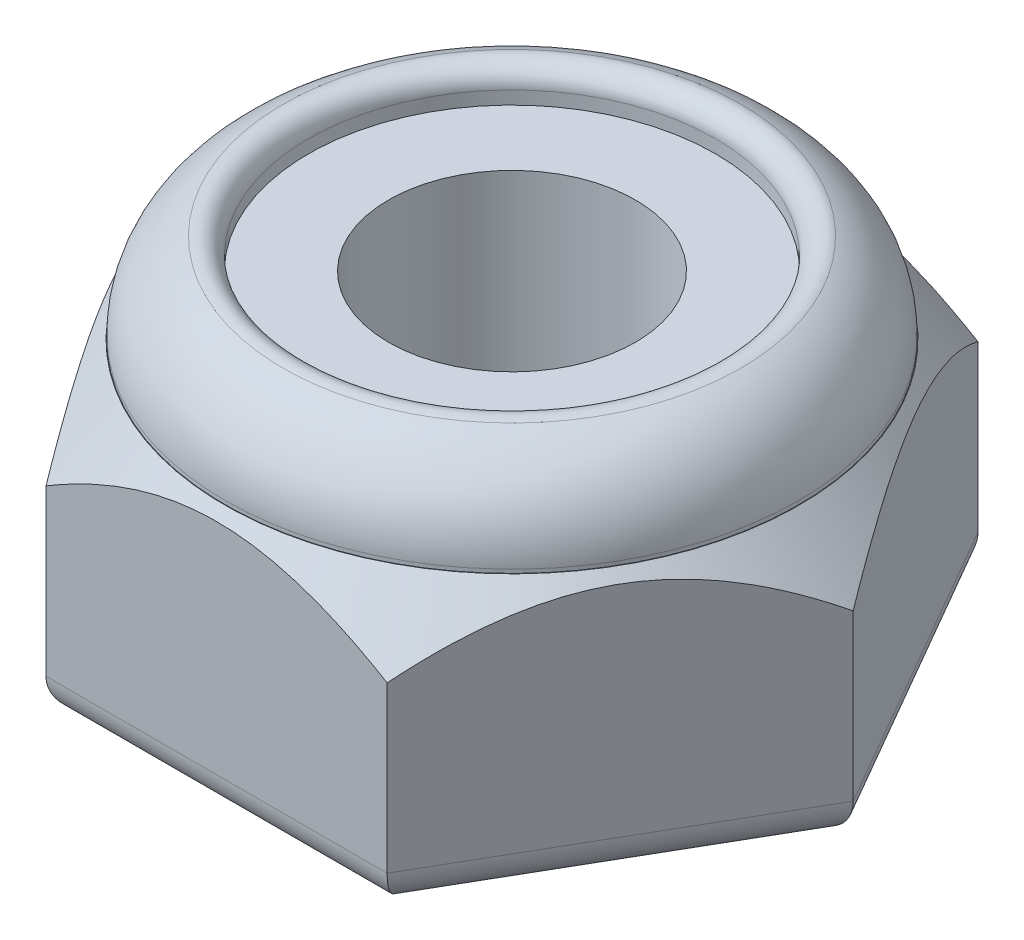
ISO-10303-21;
HEADER;
FILE_DESCRIPTION(('STEP AP214'),'2;1');
FILE_NAME('part.step','',(''),(''),'','','');
FILE_SCHEMA(('AUTOMOTIVE_DESIGN { 1 0 10303 214 1 1 1 1 }'));
ENDSEC;
DATA;
#1=APPLICATION_CONTEXT('core data for automotive mechanical design processes');
#2=APPLICATION_PROTOCOL_DEFINITION('international standard','automotive_design',2000,#1);
#3=PRODUCT_CONTEXT('',#1,'mechanical');
#4=PRODUCT('Part','Part','',(#3));
#5=PRODUCT_RELATED_PRODUCT_CATEGORY('part','',(#4));
#6=PRODUCT_DEFINITION_FORMATION('','',#4);
#7=PRODUCT_DEFINITION_CONTEXT('part definition',#1,'design');
#8=PRODUCT_DEFINITION('design','',#6,#7);
#9=PRODUCT_DEFINITION_SHAPE('','',#8);
#10=(LENGTH_UNIT() NAMED_UNIT(*) SI_UNIT(.MILLI.,.METRE.));
#11=(NAMED_UNIT(*) PLANE_ANGLE_UNIT() SI_UNIT($,.RADIAN.));
#12=(NAMED_UNIT(*) SI_UNIT($,.STERADIAN.) SOLID_ANGLE_UNIT());
#13=UNCERTAINTY_MEASURE_WITH_UNIT(LENGTH_MEASURE(1.E-05),#10,'distance_accuracy_value','');
#14=(GEOMETRIC_REPRESENTATION_CONTEXT(3) GLOBAL_UNCERTAINTY_ASSIGNED_CONTEXT((#13)) GLOBAL_UNIT_ASSIGNED_CONTEXT((#10,
#11,#12)) REPRESENTATION_CONTEXT('',''));
#15=CARTESIAN_POINT('',(0.,0.,0.));
#16=DIRECTION('',(0.,0.,1.));
#17=DIRECTION('',(1.,0.,0.));
#18=AXIS2_PLACEMENT_3D('',#15,#16,#17);
#19=CARTESIAN_POINT('',(0.,4.9784,0.));
#20=DIRECTION('',(0.,-1.,0.));
#21=DIRECTION('',(0.,0.,-1.));
#22=AXIS2_PLACEMENT_3D('',#19,#20,#21);
#23=CYLINDRICAL_SURFACE('',#22,3.937);
#24=CARTESIAN_POINT('',(0.,3.7084,0.));
#25=DIRECTION('',(0.,1.,0.));
#26=DIRECTION('',(0.,0.,1.));
#27=AXIS2_PLACEMENT_3D('',#24,#25,#26);
#28=CIRCLE('',#27,3.937);
#29=CARTESIAN_POINT('',(0.,3.7084,3.937));
#30=VERTEX_POINT('',#29);
#31=EDGE_CURVE('E244',#30,#30,#28,.T.);
#32=ORIENTED_EDGE('',*,*,#31,.F.);
#33=EDGE_LOOP('',(#32));
#34=FACE_BOUND('',#33,.T.);
#35=CARTESIAN_POINT('',(0.,3.6576,0.));
#36=DIRECTION('',(0.,-1.,0.));
#37=DIRECTION('',(0.,0.,-1.));
#38=AXIS2_PLACEMENT_3D('',#35,#36,#37);
#39=CIRCLE('',#38,3.937);
#40=CARTESIAN_POINT('',(0.,3.6576,-3.937));
#41=VERTEX_POINT('',#40);
#42=EDGE_CURVE('E20',#41,#41,#39,.F.);
#43=ORIENTED_EDGE('',*,*,#42,.T.);
#44=EDGE_LOOP('',(#43));
#45=FACE_BOUND('',#44,.T.);
#46=ADVANCED_FACE('F17',(#34,#45),#23,.T.);
#47=CARTESIAN_POINT('',(0.,3.7084,0.));
#48=DIRECTION('',(0.,1.,0.));
#49=DIRECTION('',(0.,0.,1.));
#50=AXIS2_PLACEMENT_3D('',#47,#48,#49);
#51=TOROIDAL_SURFACE('',#50,2.667,1.27);
#52=ORIENTED_EDGE('',*,*,#31,.T.);
#53=EDGE_LOOP('',(#52));
#54=FACE_BOUND('',#53,.T.);
#55=CARTESIAN_POINT('',(0.,4.88572150982644,0.));
#56=DIRECTION('',(0.,-1.,0.));
#57=DIRECTION('',(0.,0.,-1.));
#58=AXIS2_PLACEMENT_3D('',#55,#56,#57);
#59=CIRCLE('',#58,3.14325);
#60=CARTESIAN_POINT('',(0.,4.88572150982644,-3.14325));
#61=VERTEX_POINT('',#60);
#62=EDGE_CURVE('E238',#61,#61,#59,.F.);
#63=ORIENTED_EDGE('',*,*,#62,.F.);
#64=EDGE_LOOP('',(#63));
#65=FACE_BOUND('',#64,.T.);
#66=ADVANCED_FACE('F135',(#54,#65),#51,.T.);
#67=CARTESIAN_POINT('',(2.34315,3.6576,4.05845484975502));
#68=DIRECTION('',(0.,-1.,0.));
#69=DIRECTION('',(0.,0.,-1.));
#70=AXIS2_PLACEMENT_3D('',#67,#68,#69);
#71=PLANE('',#70);
#72=ORIENTED_EDGE('',*,*,#42,.F.);
#73=EDGE_LOOP('',(#72));
#74=FACE_BOUND('',#73,.T.);
#75=CARTESIAN_POINT('',(0.,3.65760000011051,0.));
#76=DIRECTION('',(0.,-1.,0.));
#77=DIRECTION('',(0.,0.,-1.));
#78=AXIS2_PLACEMENT_3D('',#75,#76,#77);
#79=CIRCLE('',#78,3.94407100938664);
#80=CARTESIAN_POINT('',(0.,3.65760000011051,-3.94407100938664));
#81=VERTEX_POINT('',#80);
#82=EDGE_CURVE('E120',#81,#81,#79,.T.);
#83=ORIENTED_EDGE('',*,*,#82,.F.);
#84=EDGE_LOOP('',(#83));
#85=FACE_BOUND('',#84,.T.);
#86=ADVANCED_FACE('F130',(#74,#85),#71,.F.);
#87=CARTESIAN_POINT('',(0.,4.65025720786115,0.));
#88=DIRECTION('',(0.,-1.,0.));
#89=DIRECTION('',(0.,0.,-1.));
#90=AXIS2_PLACEMENT_3D('',#87,#88,#89);
#91=TOROIDAL_SURFACE('',#90,3.048,0.254);
#92=CARTESIAN_POINT('',(0.,4.65025720786115,0.));
#93=DIRECTION('',(0.,1.,0.));
#94=DIRECTION('',(0.,0.,1.));
#95=AXIS2_PLACEMENT_3D('',#92,#93,#94);
#96=CIRCLE('',#95,2.794);
#97=CARTESIAN_POINT('',(0.,4.65025720786115,2.794));
#98=VERTEX_POINT('',#97);
#99=EDGE_CURVE('E105',#98,#98,#96,.F.);
#100=ORIENTED_EDGE('',*,*,#99,.T.);
#101=EDGE_LOOP('',(#100));
#102=FACE_BOUND('',#101,.T.);
#103=ORIENTED_EDGE('',*,*,#62,.T.);
#104=EDGE_LOOP('',(#103));
#105=FACE_BOUND('',#104,.T.);
#106=ADVANCED_FACE('F126',(#102,#105),#91,.T.);
#107=CARTESIAN_POINT('',(0.,2.76773860969115,0.));
#108=DIRECTION('',(0.,-1.,0.));
#109=DIRECTION('',(0.,0.,-1.));
#110=AXIS2_PLACEMENT_3D('',#107,#108,#109);
#111=CONICAL_SURFACE('',#110,4.69075337389313,0.698131700802158);
#112=CARTESIAN_POINT('',(-4.68630000001476,2.77304593398821,-5.33338044389321E-11));
#113=CARTESIAN_POINT('',(-4.65177717141793,2.81418235889091,0.0597952931149053));
#114=CARTESIAN_POINT('',(-4.61695780288956,2.85432113110728,0.120104208500933));
#115=CARTESIAN_POINT('',(-4.54666264441453,2.93230661020916,0.241858994511412));
#116=CARTESIAN_POINT('',(-4.51118655194523,2.97015222462005,0.303305389120424));
#117=CARTESIAN_POINT('',(-4.40329561885259,3.08018701500149,0.490177966909937));
#118=CARTESIAN_POINT('',(-4.32983334004397,3.14837015576205,0.617418366247689));
#119=CARTESIAN_POINT('',(-4.1797796499728,3.27092778609509,0.877318981315214));
#120=CARTESIAN_POINT('',(-4.10317943932402,3.32525984886677,1.00999443802899));
#121=CARTESIAN_POINT('',(-3.94747591651277,3.41577217646148,1.27968085045525));
#122=CARTESIAN_POINT('',(-3.86837998243724,3.45200143013375,1.4166790269463));
#123=CARTESIAN_POINT('',(-3.73746585196202,3.49372811243502,1.64342895235813));
#124=CARTESIAN_POINT('',(-3.68614686019516,3.50560413715319,1.73231605349153));
#125=CARTESIAN_POINT('',(-3.58316406708587,3.52008140702852,1.91068748346216));
#126=CARTESIAN_POINT('',(-3.53150020834088,3.5226810675312,2.00017191172355));
#127=CARTESIAN_POINT('',(-3.42855034551142,3.51847006524789,2.17848630477643));
#128=CARTESIAN_POINT('',(-3.3772638088531,3.51171021118306,2.26731719201287));
#129=CARTESIAN_POINT('',(-3.27519197708947,3.48921023555424,2.4441107906491));
#130=CARTESIAN_POINT('',(-3.22440670715057,3.4734696654174,2.53207345845939));
#131=CARTESIAN_POINT('',(-3.10963060134479,3.42817062222156,2.73087150520989));
#132=CARTESIAN_POINT('',(-3.04589899577138,3.39598542076133,2.84125788411099));
#133=CARTESIAN_POINT('',(-2.92018166739655,3.32004827846255,3.05900668424801));
#134=CARTESIAN_POINT('',(-2.85819691962206,3.27629001415058,3.16636741668776));
#135=CARTESIAN_POINT('',(-2.735889068299,3.17910361386979,3.37821082934389));
#136=CARTESIAN_POINT('',(-2.67557364738244,3.12563730731956,3.48268020285126));
#137=CARTESIAN_POINT('',(-2.55683004320588,3.01104764609313,3.68835015835892));
#138=CARTESIAN_POINT('',(-2.49840123089761,2.94992687749399,3.78955182990274));
#139=CARTESIAN_POINT('',(-2.42439626092569,2.86741854625153,3.91773219790672));
#140=CARTESIAN_POINT('',(-2.40802320106583,2.84883596648691,3.94609116945937));
#141=CARTESIAN_POINT('',(-2.3754621576302,2.81125673907332,4.00248855103733));
#142=CARTESIAN_POINT('',(-2.35927376441604,2.79226151161516,4.03052767057717));
#143=CARTESIAN_POINT('',(-2.3431499999717,2.77304593399368,4.05845484980404));
#144=B_SPLINE_CURVE_WITH_KNOTS('',3,(#112,#113,#114,#115,#116,#117,#118,#119,#120,#121,#122,
#123,#124,#125,#126,#127,#128,#129,#130,#131,#132,#133,#134,#135,#136,#137,#138,#139,#140,#141,
#142,#143),.UNSPECIFIED.,.F.,.F.,(4,2,2,2,2,2,2,2,2,2,2,2,2,2,2,4),(0.,0.241096809088565,
0.48230758945251,0.967637153847366,1.45443592242802,1.93991010956963,2.24950193433618,
2.55914664324831,2.86711700071403,3.17510274216898,3.56882084711336,3.96275452403261,
4.35827201930639,4.75365624679115,4.86660838982692,4.97921936905084),.UNSPECIFIED.);
#145=CARTESIAN_POINT('',(-4.68630000002839,2.77304593399358,0.));
#146=VERTEX_POINT('',#145);
#147=CARTESIAN_POINT('',(-2.34315000001419,2.77304593399358,4.05845484977959));
#148=VERTEX_POINT('',#147);
#149=EDGE_CURVE('E92',#146,#148,#144,.T.);
#150=ORIENTED_EDGE('',*,*,#149,.T.);
#151=CARTESIAN_POINT('',(-2.34315000005357,2.77304593398822,4.05845484974113));
#152=CARTESIAN_POINT('',(-2.27415972170409,2.81414935271336,4.05845484974989));
#153=CARTESIAN_POINT('',(-2.20457738522044,2.85425669884705,4.05845484975361));
#154=CARTESIAN_POINT('',(-2.06410193528095,2.93218331968194,4.05845484975642));
#155=CARTESIAN_POINT('',(-1.99320821641151,2.9700015013142,4.05845484975551));
#156=CARTESIAN_POINT('',(-1.77754688772429,3.07999086386455,4.05845484975401));
#157=CARTESIAN_POINT('',(-1.63068545869954,3.1481589403704,4.05845484975469));
#158=CARTESIAN_POINT('',(-1.33052752457963,3.27077676919262,4.05845484975534));
#159=CARTESIAN_POINT('',(-1.17720631609342,3.32516696804196,4.0584548497553));
#160=CARTESIAN_POINT('',(-0.86561350380778,3.41574608766059,4.05845484975473));
#161=CARTESIAN_POINT('',(-0.707359229311903,3.45199244874899,4.0584548497542));
#162=CARTESIAN_POINT('',(-0.456822143345071,3.49192146546895,4.05845484975548));
#163=CARTESIAN_POINT('',(-0.365672921156202,3.50290887295604,4.05845484975637));
#164=CARTESIAN_POINT('',(-0.183016322004482,3.51758027913678,4.05845484975366));
#165=CARTESIAN_POINT('',(-0.0915105175250816,3.52128341037061,4.05845484975007));
#166=CARTESIAN_POINT('',(0.104649468641441,3.52128177491765,4.0584548497495));
#167=CARTESIAN_POINT('',(0.209305100872023,3.51643705333648,4.05845484975354));
#168=CARTESIAN_POINT('',(0.41778718190987,3.49730239560235,4.05845484975649));
#169=CARTESIAN_POINT('',(0.521613181352877,3.48300765111694,4.05845484975541));
#170=CARTESIAN_POINT('',(0.728332544913561,3.44553375886282,4.05845484975462));
#171=CARTESIAN_POINT('',(0.831215331558566,3.42229697724238,4.05845484975491));
#172=CARTESIAN_POINT('',(1.03487580391125,3.36791830054733,4.05845484975512));
#173=CARTESIAN_POINT('',(1.13565289468809,3.33677420321768,4.05845484975504));
#174=CARTESIAN_POINT('',(1.33273383822163,3.26838741918099,4.05845484975499));
#175=CARTESIAN_POINT('',(1.42908716226035,3.23128582684656,4.05845484975501));
#176=CARTESIAN_POINT('',(1.61947291708309,3.15151071591982,4.05845484975502));
#177=CARTESIAN_POINT('',(1.71350470709807,3.10883567899407,4.05845484975502));
#178=CARTESIAN_POINT('',(1.89803195382395,3.01941532331662,4.05845484975501));
#179=CARTESIAN_POINT('',(1.98855798046432,2.97273255726059,4.05845484975502));
#180=CARTESIAN_POINT('',(2.16742834958163,2.87556944084479,4.05845484975502));
#181=CARTESIAN_POINT('',(2.25577492892455,2.82509321932285,4.05845484975502));
#182=CARTESIAN_POINT('',(2.34315000005566,2.77304593399424,4.05845484975502));
#183=B_SPLINE_CURVE_WITH_KNOTS('',3,(#151,#152,#153,#154,#155,#156,#157,#158,#159,#160,#161,
#162,#163,#164,#165,#166,#167,#168,#169,#170,#171,#172,#173,#174,#175,#176,#177,#178,#179,#180,
#181,#182),.UNSPECIFIED.,.F.,.F.,(4,2,2,2,2,2,2,2,2,2,2,2,2,2,2,4),(0.,0.24090330355952,
0.481920744736242,0.967059466968447,1.4542606837498,1.93990959177134,2.21507934695766,
2.4895253838939,2.80337599596431,3.11738642360393,3.43345557972405,3.74961286055439,
4.0591611810716,4.36879400620232,4.67425708545866,4.97939238068026),.UNSPECIFIED.);
#184=CARTESIAN_POINT('',(2.34315000001419,2.77304593399358,4.05845484977959));
#185=VERTEX_POINT('',#184);
#186=EDGE_CURVE('E84',#148,#185,#183,.T.);
#187=ORIENTED_EDGE('',*,*,#186,.T.);
#188=CARTESIAN_POINT('',(2.3431499999612,2.77304593398822,4.05845484979446));
#189=CARTESIAN_POINT('',(2.37767282857321,2.81418235889091,3.99865955663499));
#190=CARTESIAN_POINT('',(2.41249219710801,2.85432113110729,3.93835064125267));
#191=CARTESIAN_POINT('',(2.48278735558791,2.93230661020917,3.816595855245));
#192=CARTESIAN_POINT('',(2.51826344805563,2.97015222462005,3.75514946063508));
#193=CARTESIAN_POINT('',(2.62615438114571,3.0801870150015,3.56827688284408));
#194=CARTESIAN_POINT('',(2.69961665995557,3.14837015576206,3.44103648350706));
#195=CARTESIAN_POINT('',(2.84967035002766,3.2709277860951,3.18113586844006));
#196=CARTESIAN_POINT('',(2.9262705606761,3.32525984886677,3.04846041172609));
#197=CARTESIAN_POINT('',(3.08197408348711,3.41577217646148,2.77877399929969));
#198=CARTESIAN_POINT('',(3.16107001756274,3.45200143013376,2.64177582280869));
#199=CARTESIAN_POINT('',(3.291984148038,3.49372811243503,2.41502589739689));
#200=CARTESIAN_POINT('',(3.34330313980485,3.50560413715319,2.32613879626348));
#201=CARTESIAN_POINT('',(3.44628593291413,3.52008140702853,2.14776736629285));
#202=CARTESIAN_POINT('',(3.49794979165912,3.52268106753121,2.05828293803146));
#203=CARTESIAN_POINT('',(3.60089965448859,3.51847006524789,1.87996854497858));
#204=CARTESIAN_POINT('',(3.6521861911469,3.51171021118306,1.79113765774214));
#205=CARTESIAN_POINT('',(3.75425802291053,3.48921023555425,1.61434405910591));
#206=CARTESIAN_POINT('',(3.80504329284943,3.47346966541741,1.52638139129562));
#207=CARTESIAN_POINT('',(3.91981939865521,3.42817062222156,1.32758334454512));
#208=CARTESIAN_POINT('',(3.98355100422862,3.39598542076133,1.21719696564402));
#209=CARTESIAN_POINT('',(4.10926833260345,3.32004827846255,0.999448165506998));
#210=CARTESIAN_POINT('',(4.17125308037794,3.27629001415058,0.892087433067249));
#211=CARTESIAN_POINT('',(4.293560931701,3.17910361386979,0.680244020411123));
#212=CARTESIAN_POINT('',(4.35387635261756,3.12563730731956,0.575774646903748));
#213=CARTESIAN_POINT('',(4.47261995679412,3.01104764609313,0.370104691396085));
#214=CARTESIAN_POINT('',(4.53104876910239,2.94992687749399,0.268903019852267));
#215=CARTESIAN_POINT('',(4.60505373907431,2.86741854625153,0.140722651848287));
#216=CARTESIAN_POINT('',(4.62142679893417,2.84883596648691,0.112363680295637));
#217=CARTESIAN_POINT('',(4.6539878423698,2.81125673907332,0.0559662987176779));
#218=CARTESIAN_POINT('',(4.67017623558396,2.79226151161516,0.0279271791778418));
#219=CARTESIAN_POINT('',(4.6863000000283,2.77304593399368,-4.90270010654762E-11));
#220=B_SPLINE_CURVE_WITH_KNOTS('',3,(#188,#189,#190,#191,#192,#193,#194,#195,#196,#197,#198,
#199,#200,#201,#202,#203,#204,#205,#206,#207,#208,#209,#210,#211,#212,#213,#214,#215,#216,#217,
#218,#219),.UNSPECIFIED.,.F.,.F.,(4,2,2,2,2,2,2,2,2,2,2,2,2,2,2,4),(0.,0.241096809088565,
0.48230758945251,0.967637153847364,1.45443592242802,1.93991010956962,2.24950193433617,
2.5591466432483,2.86711700071402,3.17510274216897,3.56882084711336,3.9627545240326,
4.35827201930639,4.75365624679114,4.86660838982692,4.97921936905084),.UNSPECIFIED.);
#221=CARTESIAN_POINT('',(4.68630000001419,2.7730459340105,-2.45819040202403E-11));
#222=VERTEX_POINT('',#221);
#223=EDGE_CURVE('E89',#185,#222,#220,.T.);
#224=ORIENTED_EDGE('',*,*,#223,.T.);
#225=CARTESIAN_POINT('',(4.68630000001476,2.77304593398822,5.33267015141622E-11));
#226=CARTESIAN_POINT('',(4.65177717141792,2.81418235889091,-0.0597952931149122));
#227=CARTESIAN_POINT('',(4.61695780288956,2.85432113110729,-0.12010420850094));
#228=CARTESIAN_POINT('',(4.54666264441452,2.93230661020917,-0.241858994511418));
#229=CARTESIAN_POINT('',(4.51118655194522,2.97015222462005,-0.303305389120429));
#230=CARTESIAN_POINT('',(4.40329561885258,3.0801870150015,-0.490177966909942));
#231=CARTESIAN_POINT('',(4.32983334004397,3.14837015576206,-0.617418366247693));
#232=CARTESIAN_POINT('',(4.1797796499728,3.27092778609509,-0.877318981315217));
#233=CARTESIAN_POINT('',(4.10317943932402,3.32525984886677,-1.00999443802899));
#234=CARTESIAN_POINT('',(3.94747591651277,3.41577217646148,-1.27968085045525));
#235=CARTESIAN_POINT('',(3.86837998243724,3.45200143013375,-1.4166790269463));
#236=CARTESIAN_POINT('',(3.73746585196202,3.49372811243502,-1.64342895235813));
#237=CARTESIAN_POINT('',(3.68614686019516,3.50560413715319,-1.73231605349153));
#238=CARTESIAN_POINT('',(3.58316406708587,3.52008140702852,-1.91068748346216));
#239=CARTESIAN_POINT('',(3.53150020834088,3.5226810675312,-2.00017191172355));
#240=CARTESIAN_POINT('',(3.42855034551142,3.51847006524789,-2.17848630477643));
#241=CARTESIAN_POINT('',(3.3772638088531,3.51171021118306,-2.26731719201287));
#242=CARTESIAN_POINT('',(3.27519197708947,3.48921023555424,-2.4441107906491));
#243=CARTESIAN_POINT('',(3.22440670715057,3.4734696654174,-2.53207345845939));
#244=CARTESIAN_POINT('',(3.10963060134479,3.42817062222156,-2.73087150520989));
#245=CARTESIAN_POINT('',(3.04589899577138,3.39598542076133,-2.84125788411098));
#246=CARTESIAN_POINT('',(2.92018166739655,3.32004827846255,-3.05900668424801));
#247=CARTESIAN_POINT('',(2.85819691962206,3.27629001415058,-3.16636741668776));
#248=CARTESIAN_POINT('',(2.735889068299,3.17910361386979,-3.37821082934388));
#249=CARTESIAN_POINT('',(2.67557364738245,3.12563730731956,-3.48268020285126));
#250=CARTESIAN_POINT('',(2.55683004320588,3.01104764609313,-3.68835015835892));
#251=CARTESIAN_POINT('',(2.49840123089761,2.94992687749399,-3.78955182990274));
#252=CARTESIAN_POINT('',(2.42439626092569,2.86741854625153,-3.91773219790672));
#253=CARTESIAN_POINT('',(2.40802320106583,2.84883596648691,-3.94609116945937));
#254=CARTESIAN_POINT('',(2.3754621576302,2.81125673907332,-4.00248855103733));
#255=CARTESIAN_POINT('',(2.35927376441604,2.79226151161516,-4.03052767057717));
#256=CARTESIAN_POINT('',(2.3431499999717,2.77304593399368,-4.05845484980404));
#257=B_SPLINE_CURVE_WITH_KNOTS('',3,(#225,#226,#227,#228,#229,#230,#231,#232,#233,#234,#235,
#236,#237,#238,#239,#240,#241,#242,#243,#244,#245,#246,#247,#248,#249,#250,#251,#252,#253,#254,
#255,#256),.UNSPECIFIED.,.F.,.F.,(4,2,2,2,2,2,2,2,2,2,2,2,2,2,2,4),(0.,0.241096809088563,
0.482307589452507,0.967637153847359,1.45443592242801,1.93991010956962,2.24950193433616,
2.55914664324829,2.86711700071401,3.17510274216897,3.56882084711335,3.96275452403259,
4.35827201930638,4.75365624679114,4.86660838982692,4.97921936905084),.UNSPECIFIED.);
#258=CARTESIAN_POINT('',(2.34315000001419,2.77304593399358,-4.0584548497796));
#259=VERTEX_POINT('',#258);
#260=EDGE_CURVE('E194',#222,#259,#257,.T.);
#261=ORIENTED_EDGE('',*,*,#260,.T.);
#262=CARTESIAN_POINT('',(2.34315000005357,2.77304593398821,-4.05845484974114));
#263=CARTESIAN_POINT('',(2.27415972170409,2.81414935271335,-4.05845484974989));
#264=CARTESIAN_POINT('',(2.20457738522045,2.85425669884704,-4.05845484975361));
#265=CARTESIAN_POINT('',(2.06410193528096,2.93218331968193,-4.05845484975643));
#266=CARTESIAN_POINT('',(1.99320821641151,2.97000150131419,-4.05845484975552));
#267=CARTESIAN_POINT('',(1.77754688772429,3.07999086386454,-4.05845484975402));
#268=CARTESIAN_POINT('',(1.63068545869954,3.1481589403704,-4.0584548497547));
#269=CARTESIAN_POINT('',(1.33052752457963,3.27077676919261,-4.05845484975534));
#270=CARTESIAN_POINT('',(1.17720631609342,3.32516696804195,-4.0584548497553));
#271=CARTESIAN_POINT('',(0.865613503807778,3.41574608766058,-4.05845484975474));
#272=CARTESIAN_POINT('',(0.707359229311901,3.45199244874898,-4.0584548497542));
#273=CARTESIAN_POINT('',(0.456822143345069,3.49192146546895,-4.05845484975548));
#274=CARTESIAN_POINT('',(0.365672921156201,3.50290887295604,-4.05845484975637));
#275=CARTESIAN_POINT('',(0.183016322004481,3.51758027913677,-4.05845484975367));
#276=CARTESIAN_POINT('',(0.0915105175250814,3.5212834103706,-4.05845484975008));
#277=CARTESIAN_POINT('',(-0.104649468641441,3.52128177491764,-4.0584548497495));
#278=CARTESIAN_POINT('',(-0.209305100872023,3.51643705333648,-4.05845484975354));
#279=CARTESIAN_POINT('',(-0.41778718190987,3.49730239560234,-4.0584548497565));
#280=CARTESIAN_POINT('',(-0.521613181352877,3.48300765111693,-4.05845484975542));
#281=CARTESIAN_POINT('',(-0.728332544913562,3.44553375886281,-4.05845484975462));
#282=CARTESIAN_POINT('',(-0.831215331558566,3.42229697724237,-4.05845484975491));
#283=CARTESIAN_POINT('',(-1.03487580391125,3.36791830054732,-4.05845484975513));
#284=CARTESIAN_POINT('',(-1.13565289468809,3.33677420321767,-4.05845484975505));
#285=CARTESIAN_POINT('',(-1.33273383822163,3.26838741918098,-4.05845484975499));
#286=CARTESIAN_POINT('',(-1.42908716226035,3.23128582684655,-4.05845484975501));
#287=CARTESIAN_POINT('',(-1.61947291708309,3.15151071591982,-4.05845484975503));
#288=CARTESIAN_POINT('',(-1.71350470709807,3.10883567899406,-4.05845484975502));
#289=CARTESIAN_POINT('',(-1.89803195382395,3.01941532331662,-4.05845484975502));
#290=CARTESIAN_POINT('',(-1.98855798046431,2.97273255726059,-4.05845484975502));
#291=CARTESIAN_POINT('',(-2.16742834958162,2.87556944084479,-4.05845484975502));
#292=CARTESIAN_POINT('',(-2.25577492892455,2.82509321932284,-4.05845484975502));
#293=CARTESIAN_POINT('',(-2.34315000005566,2.77304593399424,-4.05845484975502));
#294=B_SPLINE_CURVE_WITH_KNOTS('',3,(#262,#263,#264,#265,#266,#267,#268,#269,#270,#271,#272,
#273,#274,#275,#276,#277,#278,#279,#280,#281,#282,#283,#284,#285,#286,#287,#288,#289,#290,#291,
#292,#293),.UNSPECIFIED.,.F.,.F.,(4,2,2,2,2,2,2,2,2,2,2,2,2,2,2,4),(0.,0.24090330355952,
0.481920744736243,0.96705946696845,1.4542606837498,1.93990959177135,2.21507934695766,
2.48952538389391,2.80337599596432,3.11738642360394,3.43345557972405,3.74961286055439,
4.0591611810716,4.36879400620232,4.67425708545866,4.97939238068026),.UNSPECIFIED.);
#295=CARTESIAN_POINT('',(-2.34315000001419,2.77304593399358,-4.0584548497796));
#296=VERTEX_POINT('',#295);
#297=EDGE_CURVE('E204',#259,#296,#294,.T.);
#298=ORIENTED_EDGE('',*,*,#297,.T.);
#299=CARTESIAN_POINT('',(-2.3431499999612,2.77304593398821,-4.05845484979447));
#300=CARTESIAN_POINT('',(-2.37767282857321,2.81418235889091,-3.99865955663499));
#301=CARTESIAN_POINT('',(-2.41249219710802,2.85432113110728,-3.93835064125268));
#302=CARTESIAN_POINT('',(-2.48278735558791,2.93230661020916,-3.81659585524501));
#303=CARTESIAN_POINT('',(-2.51826344805563,2.97015222462005,-3.75514946063508));
#304=CARTESIAN_POINT('',(-2.62615438114571,3.08018701500149,-3.56827688284409));
#305=CARTESIAN_POINT('',(-2.69961665995557,3.14837015576205,-3.44103648350706));
#306=CARTESIAN_POINT('',(-2.84967035002766,3.27092778609509,-3.18113586844007));
#307=CARTESIAN_POINT('',(-2.9262705606761,3.32525984886676,-3.0484604117261));
#308=CARTESIAN_POINT('',(-3.08197408348711,3.41577217646147,-2.7787739992997));
#309=CARTESIAN_POINT('',(-3.16107001756274,3.45200143013375,-2.6417758228087));
#310=CARTESIAN_POINT('',(-3.291984148038,3.49372811243502,-2.4150258973969));
#311=CARTESIAN_POINT('',(-3.34330313980485,3.50560413715318,-2.32613879626349));
#312=CARTESIAN_POINT('',(-3.44628593291413,3.52008140702852,-2.14776736629286));
#313=CARTESIAN_POINT('',(-3.49794979165912,3.5226810675312,-2.05828293803147));
#314=CARTESIAN_POINT('',(-3.60089965448859,3.51847006524788,-1.87996854497859));
#315=CARTESIAN_POINT('',(-3.6521861911469,3.51171021118305,-1.79113765774215));
#316=CARTESIAN_POINT('',(-3.75425802291053,3.48921023555424,-1.61434405910592));
#317=CARTESIAN_POINT('',(-3.80504329284944,3.4734696654174,-1.52638139129563));
#318=CARTESIAN_POINT('',(-3.91981939865521,3.42817062222155,-1.32758334454513));
#319=CARTESIAN_POINT('',(-3.98355100422863,3.39598542076132,-1.21719696564403));
#320=CARTESIAN_POINT('',(-4.10926833260346,3.32004827846254,-0.999448165507007));
#321=CARTESIAN_POINT('',(-4.17125308037794,3.27629001415057,-0.892087433067259));
#322=CARTESIAN_POINT('',(-4.29356093170101,3.17910361386978,-0.680244020411133));
#323=CARTESIAN_POINT('',(-4.35387635261756,3.12563730731955,-0.575774646903757));
#324=CARTESIAN_POINT('',(-4.47261995679413,3.01104764609312,-0.370104691396094));
#325=CARTESIAN_POINT('',(-4.53104876910239,2.94992687749399,-0.268903019852276));
#326=CARTESIAN_POINT('',(-4.60505373907432,2.86741854625152,-0.140722651848295));
#327=CARTESIAN_POINT('',(-4.62142679893418,2.84883596648691,-0.112363680295645));
#328=CARTESIAN_POINT('',(-4.6539878423698,2.81125673907331,-0.0559662987176854));
#329=CARTESIAN_POINT('',(-4.67017623558397,2.79226151161515,-0.0279271791778493));
#330=CARTESIAN_POINT('',(-4.68630000002831,2.77304593399367,4.90195592876359E-11));
#331=B_SPLINE_CURVE_WITH_KNOTS('',3,(#299,#300,#301,#302,#303,#304,#305,#306,#307,#308,#309,
#310,#311,#312,#313,#314,#315,#316,#317,#318,#319,#320,#321,#322,#323,#324,#325,#326,#327,#328,
#329,#330),.UNSPECIFIED.,.F.,.F.,(4,2,2,2,2,2,2,2,2,2,2,2,2,2,2,4),(0.,0.241096809088565,
0.482307589452509,0.967637153847361,1.45443592242802,1.93991010956962,2.24950193433617,
2.5591466432483,2.86711700071402,3.17510274216897,3.56882084711335,3.9627545240326,
4.35827201930639,4.75365624679114,4.86660838982692,4.97921936905084),.UNSPECIFIED.);
#332=EDGE_CURVE('E210',#296,#146,#331,.T.);
#333=ORIENTED_EDGE('',*,*,#332,.T.);
#334=EDGE_LOOP('',(#150,#187,#224,#261,#298,#333));
#335=FACE_BOUND('',#334,.T.);
#336=ORIENTED_EDGE('',*,*,#82,.T.);
#337=EDGE_LOOP('',(#336));
#338=FACE_BOUND('',#337,.T.);
#339=ADVANCED_FACE('F86',(#335,#338),#111,.T.);
#340=CARTESIAN_POINT('',(0.,4.4704,0.));
#341=DIRECTION('',(0.,1.,0.));
#342=DIRECTION('',(0.,0.,1.));
#343=AXIS2_PLACEMENT_3D('',#340,#341,#342);
#344=CYLINDRICAL_SURFACE('',#343,2.794);
#345=ORIENTED_EDGE('',*,*,#99,.F.);
#346=EDGE_LOOP('',(#345));
#347=FACE_BOUND('',#346,.T.);
#348=CARTESIAN_POINT('',(0.,4.4704,0.));
#349=DIRECTION('',(0.,1.,0.));
#350=DIRECTION('',(0.,0.,1.));
#351=AXIS2_PLACEMENT_3D('',#348,#349,#350);
#352=CIRCLE('',#351,2.794);
#353=CARTESIAN_POINT('',(0.,4.4704,2.794));
#354=VERTEX_POINT('',#353);
#355=EDGE_CURVE('E202',#354,#354,#352,.T.);
#356=ORIENTED_EDGE('',*,*,#355,.F.);
#357=EDGE_LOOP('',(#356));
#358=FACE_BOUND('',#357,.T.);
#359=ADVANCED_FACE('F406',(#347,#358),#344,.F.);
#360=CARTESIAN_POINT('',(2.34315,3.6576,4.05845484975502));
#361=DIRECTION('',(-0.866025403784439,0.,-0.499999999999999));
#362=DIRECTION('',(-0.499999999999999,0.,0.866025403784439));
#363=AXIS2_PLACEMENT_3D('',#360,#361,#362);
#364=PLANE('',#363);
#365=DIRECTION('',(-0.499999999999999,0.,0.866025403784439));
#366=VECTOR('',#365,1.);
#367=CARTESIAN_POINT('',(2.34315,0.508,4.05845484975502));
#368=LINE('',#367,#366);
#369=CARTESIAN_POINT('',(4.6863,0.508,0.));
#370=VERTEX_POINT('',#369);
#371=CARTESIAN_POINT('',(2.34315000000001,0.508,4.05845484975502));
#372=VERTEX_POINT('',#371);
#373=EDGE_CURVE('E268',#370,#372,#368,.T.);
#374=ORIENTED_EDGE('',*,*,#373,.F.);
#375=DIRECTION('',(0.,1.,0.));
#376=VECTOR('',#375,1.);
#377=CARTESIAN_POINT('',(4.6863,3.6576,0.));
#378=LINE('',#377,#376);
#379=EDGE_CURVE('E103',#370,#222,#378,.T.);
#380=ORIENTED_EDGE('',*,*,#379,.T.);
#381=ORIENTED_EDGE('',*,*,#223,.F.);
#382=DIRECTION('',(0.,1.,0.));
#383=VECTOR('',#382,1.);
#384=CARTESIAN_POINT('',(2.34315000000001,3.6576,4.05845484975502));
#385=LINE('',#384,#383);
#386=EDGE_CURVE('E96',#185,#372,#385,.F.);
#387=ORIENTED_EDGE('',*,*,#386,.T.);
#388=EDGE_LOOP('',(#374,#380,#381,#387));
#389=FACE_BOUND('',#388,.T.);
#390=ADVANCED_FACE('F100',(#389),#364,.F.);
#391=CARTESIAN_POINT('',(-2.34315,3.6576,4.05845484975501));
#392=DIRECTION('',(0.,0.,-1.));
#393=DIRECTION('',(-1.,0.,0.));
#394=AXIS2_PLACEMENT_3D('',#391,#392,#393);
#395=PLANE('',#394);
#396=DIRECTION('',(-1.,0.,0.));
#397=VECTOR('',#396,1.);
#398=CARTESIAN_POINT('',(-2.34315,0.508,4.05845484975501));
#399=LINE('',#398,#397);
#400=CARTESIAN_POINT('',(-2.34315,0.508,4.05845484975501));
#401=VERTEX_POINT('',#400);
#402=EDGE_CURVE('E110',#372,#401,#399,.T.);
#403=ORIENTED_EDGE('',*,*,#402,.F.);
#404=ORIENTED_EDGE('',*,*,#386,.F.);
#405=ORIENTED_EDGE('',*,*,#186,.F.);
#406=DIRECTION('',(0.,1.,0.));
#407=VECTOR('',#406,1.);
#408=CARTESIAN_POINT('',(-2.34315,3.6576,4.05845484975501));
#409=LINE('',#408,#407);
#410=EDGE_CURVE('E113',#148,#401,#409,.F.);
#411=ORIENTED_EDGE('',*,*,#410,.T.);
#412=EDGE_LOOP('',(#403,#404,#405,#411));
#413=FACE_BOUND('',#412,.T.);
#414=ADVANCED_FACE('F108',(#413),#395,.F.);
#415=CARTESIAN_POINT('',(-4.6863,3.6576,0.));
#416=DIRECTION('',(0.866025403784439,0.,-0.5));
#417=DIRECTION('',(-0.5,0.,-0.866025403784439));
#418=AXIS2_PLACEMENT_3D('',#415,#416,#417);
#419=PLANE('',#418);
#420=DIRECTION('',(-0.5,0.,-0.866025403784439));
#421=VECTOR('',#420,1.);
#422=CARTESIAN_POINT('',(-4.6863,0.508,0.));
#423=LINE('',#422,#421);
#424=CARTESIAN_POINT('',(-4.68630000000001,0.508,0.));
#425=VERTEX_POINT('',#424);
#426=EDGE_CURVE('E264',#401,#425,#423,.T.);
#427=ORIENTED_EDGE('',*,*,#426,.F.);
#428=ORIENTED_EDGE('',*,*,#410,.F.);
#429=ORIENTED_EDGE('',*,*,#149,.F.);
#430=DIRECTION('',(0.,1.,0.));
#431=VECTOR('',#430,1.);
#432=CARTESIAN_POINT('',(-4.68630000000001,3.6576,0.));
#433=LINE('',#432,#431);
#434=EDGE_CURVE('E209',#146,#425,#433,.F.);
#435=ORIENTED_EDGE('',*,*,#434,.T.);
#436=EDGE_LOOP('',(#427,#428,#429,#435));
#437=FACE_BOUND('',#436,.T.);
#438=ADVANCED_FACE('F221',(#437),#419,.F.);
#439=CARTESIAN_POINT('',(-2.34315,3.6576,-4.05845484975502));
#440=DIRECTION('',(0.866025403784438,0.,0.5));
#441=DIRECTION('',(0.5,0.,-0.866025403784438));
#442=AXIS2_PLACEMENT_3D('',#439,#440,#441);
#443=PLANE('',#442);
#444=DIRECTION('',(0.5,0.,-0.866025403784438));
#445=VECTOR('',#444,1.);
#446=CARTESIAN_POINT('',(-2.34315,0.508,-4.05845484975502));
#447=LINE('',#446,#445);
#448=CARTESIAN_POINT('',(-2.34315,0.508,-4.05845484975502));
#449=VERTEX_POINT('',#448);
#450=EDGE_CURVE('E260',#425,#449,#447,.T.);
#451=ORIENTED_EDGE('',*,*,#450,.F.);
#452=ORIENTED_EDGE('',*,*,#434,.F.);
#453=ORIENTED_EDGE('',*,*,#332,.F.);
#454=DIRECTION('',(0.,1.,0.));
#455=VECTOR('',#454,1.);
#456=CARTESIAN_POINT('',(-2.34315,3.6576,-4.05845484975502));
#457=LINE('',#456,#455);
#458=EDGE_CURVE('E201',#296,#449,#457,.F.);
#459=ORIENTED_EDGE('',*,*,#458,.T.);
#460=EDGE_LOOP('',(#451,#452,#453,#459));
#461=FACE_BOUND('',#460,.T.);
#462=ADVANCED_FACE('F218',(#461),#443,.F.);
#463=CARTESIAN_POINT('',(2.34315,3.6576,-4.05845484975502));
#464=DIRECTION('',(0.,0.,1.));
#465=DIRECTION('',(1.,0.,0.));
#466=AXIS2_PLACEMENT_3D('',#463,#464,#465);
#467=PLANE('',#466);
#468=DIRECTION('',(1.,0.,0.));
#469=VECTOR('',#468,1.);
#470=CARTESIAN_POINT('',(2.34315,0.508,-4.05845484975502));
#471=LINE('',#470,#469);
#472=CARTESIAN_POINT('',(2.34315,0.508,-4.05845484975502));
#473=VERTEX_POINT('',#472);
#474=EDGE_CURVE('E256',#449,#473,#471,.T.);
#475=ORIENTED_EDGE('',*,*,#474,.F.);
#476=ORIENTED_EDGE('',*,*,#458,.F.);
#477=ORIENTED_EDGE('',*,*,#297,.F.);
#478=DIRECTION('',(0.,1.,0.));
#479=VECTOR('',#478,1.);
#480=CARTESIAN_POINT('',(2.34315,3.6576,-4.05845484975501));
#481=LINE('',#480,#479);
#482=EDGE_CURVE('E200',#259,#473,#481,.F.);
#483=ORIENTED_EDGE('',*,*,#482,.T.);
#484=EDGE_LOOP('',(#475,#476,#477,#483));
#485=FACE_BOUND('',#484,.T.);
#486=ADVANCED_FACE('F189',(#485),#467,.F.);
#487=CARTESIAN_POINT('',(4.6863,3.6576,0.));
#488=DIRECTION('',(-0.866025403784439,0.,0.5));
#489=DIRECTION('',(0.5,0.,0.866025403784439));
#490=AXIS2_PLACEMENT_3D('',#487,#488,#489);
#491=PLANE('',#490);
#492=DIRECTION('',(0.5,0.,0.866025403784439));
#493=VECTOR('',#492,1.);
#494=CARTESIAN_POINT('',(4.6863,0.508,0.));
#495=LINE('',#494,#493);
#496=EDGE_CURVE('E254',#473,#370,#495,.T.);
#497=ORIENTED_EDGE('',*,*,#496,.F.);
#498=ORIENTED_EDGE('',*,*,#482,.F.);
#499=ORIENTED_EDGE('',*,*,#260,.F.);
#500=ORIENTED_EDGE('',*,*,#379,.F.);
#501=EDGE_LOOP('',(#497,#498,#499,#500));
#502=FACE_BOUND('',#501,.T.);
#503=ADVANCED_FACE('F184',(#502),#491,.F.);
#504=CARTESIAN_POINT('',(0.,4.4704,0.));
#505=DIRECTION('',(0.,1.,0.));
#506=DIRECTION('',(0.,0.,1.));
#507=AXIS2_PLACEMENT_3D('',#504,#505,#506);
#508=PLANE('',#507);
#509=CARTESIAN_POINT('',(0.,4.4704,0.));
#510=DIRECTION('',(0.,1.,0.));
#511=DIRECTION('',(0.,0.,1.));
#512=AXIS2_PLACEMENT_3D('',#509,#510,#511);
#513=CIRCLE('',#512,1.69545);
#514=CARTESIAN_POINT('',(0.,4.4704,1.69545));
#515=VERTEX_POINT('',#514);
#516=EDGE_CURVE('E247',#515,#515,#513,.F.);
#517=ORIENTED_EDGE('',*,*,#516,.T.);
#518=EDGE_LOOP('',(#517));
#519=FACE_BOUND('',#518,.T.);
#520=ORIENTED_EDGE('',*,*,#355,.T.);
#521=EDGE_LOOP('',(#520));
#522=FACE_BOUND('',#521,.T.);
#523=ADVANCED_FACE('F180',(#519,#522),#508,.T.);
#524=CARTESIAN_POINT('',(1.9032090948775,0.508,3.80445484975502));
#525=DIRECTION('',(-0.499999999999999,0.,0.866025403784439));
#526=DIRECTION('',(0.866025403784439,0.,0.499999999999999));
#527=AXIS2_PLACEMENT_3D('',#524,#525,#526);
#528=CYLINDRICAL_SURFACE('',#527,0.508);
#529=CARTESIAN_POINT('',(2.04985606325167,0.508,3.55045484975502));
#530=DIRECTION('',(-0.866025403784439,0.,0.5));
#531=DIRECTION('',(-0.5,0.,-0.866025403784439));
#532=AXIS2_PLACEMENT_3D('',#529,#530,#531);
#533=ELLIPSE('',#532,0.58658787349666,0.508);
#534=CARTESIAN_POINT('',(2.04985606325167,0.,3.55045484975502));
#535=VERTEX_POINT('',#534);
#536=EDGE_CURVE('E267',#535,#372,#533,.T.);
#537=ORIENTED_EDGE('',*,*,#536,.F.);
#538=DIRECTION('',(-0.499999999999999,0.,0.866025403784439));
#539=VECTOR('',#538,1.);
#540=CARTESIAN_POINT('',(4.09971212650334,0.,0.));
#541=LINE('',#540,#539);
#542=CARTESIAN_POINT('',(4.09971212650334,0.,0.));
#543=VERTEX_POINT('',#542);
#544=EDGE_CURVE('E250',#543,#535,#541,.T.);
#545=ORIENTED_EDGE('',*,*,#544,.F.);
#546=CARTESIAN_POINT('',(4.09971212650334,0.508,0.));
#547=DIRECTION('',(0.,0.,1.));
#548=DIRECTION('',(1.,0.,0.));
#549=AXIS2_PLACEMENT_3D('',#546,#547,#548);
#550=ELLIPSE('',#549,0.58658787349666,0.508);
#551=EDGE_CURVE('E251',#370,#543,#550,.F.);
#552=ORIENTED_EDGE('',*,*,#551,.F.);
#553=ORIENTED_EDGE('',*,*,#373,.T.);
#554=EDGE_LOOP('',(#537,#545,#552,#553));
#555=FACE_BOUND('',#554,.T.);
#556=ADVANCED_FACE('F176',(#555),#528,.T.);
#557=CARTESIAN_POINT('',(-2.34315,0.508,3.55045484975501));
#558=DIRECTION('',(-1.,0.,0.));
#559=DIRECTION('',(0.,0.,1.));
#560=AXIS2_PLACEMENT_3D('',#557,#558,#559);
#561=CYLINDRICAL_SURFACE('',#560,0.508);
#562=ORIENTED_EDGE('',*,*,#536,.T.);
#563=ORIENTED_EDGE('',*,*,#402,.T.);
#564=CARTESIAN_POINT('',(-2.04985606325167,0.508,3.55045484975501));
#565=DIRECTION('',(-0.866025403784439,0.,-0.5));
#566=DIRECTION('',(0.5,0.,-0.866025403784439));
#567=AXIS2_PLACEMENT_3D('',#564,#565,#566);
#568=ELLIPSE('',#567,0.58658787349666,0.508);
#569=CARTESIAN_POINT('',(-2.04985606325167,0.,3.55045484975502));
#570=VERTEX_POINT('',#569);
#571=EDGE_CURVE('E265',#570,#401,#568,.T.);
#572=ORIENTED_EDGE('',*,*,#571,.F.);
#573=DIRECTION('',(1.,0.,0.));
#574=VECTOR('',#573,1.);
#575=CARTESIAN_POINT('',(2.34315,0.,3.55045484975502));
#576=LINE('',#575,#574);
#577=EDGE_CURVE('E299',#535,#570,#576,.F.);
#578=ORIENTED_EDGE('',*,*,#577,.F.);
#579=EDGE_LOOP('',(#562,#563,#572,#578));
#580=FACE_BOUND('',#579,.T.);
#581=ADVANCED_FACE('F172',(#580),#561,.T.);
#582=CARTESIAN_POINT('',(-4.24635909487751,0.508,-0.254000000000004));
#583=DIRECTION('',(-0.5,0.,-0.866025403784439));
#584=DIRECTION('',(-0.866025403784439,0.,0.5));
#585=AXIS2_PLACEMENT_3D('',#582,#583,#584);
#586=CYLINDRICAL_SURFACE('',#585,0.508);
#587=ORIENTED_EDGE('',*,*,#571,.T.);
#588=ORIENTED_EDGE('',*,*,#426,.T.);
#589=CARTESIAN_POINT('',(-4.09971212650334,0.508,0.));
#590=DIRECTION('',(0.,0.,-1.));
#591=DIRECTION('',(1.,0.,0.));
#592=AXIS2_PLACEMENT_3D('',#589,#590,#591);
#593=ELLIPSE('',#592,0.58658787349666,0.508);
#594=CARTESIAN_POINT('',(-4.09971212650334,0.,0.));
#595=VERTEX_POINT('',#594);
#596=EDGE_CURVE('E261',#595,#425,#593,.T.);
#597=ORIENTED_EDGE('',*,*,#596,.F.);
#598=DIRECTION('',(-0.5,0.,-0.866025403784439));
#599=VECTOR('',#598,1.);
#600=CARTESIAN_POINT('',(-2.04985606325167,0.,3.55045484975501));
#601=LINE('',#600,#599);
#602=EDGE_CURVE('E295',#570,#595,#601,.T.);
#603=ORIENTED_EDGE('',*,*,#602,.F.);
#604=EDGE_LOOP('',(#587,#588,#597,#603));
#605=FACE_BOUND('',#604,.T.);
#606=ADVANCED_FACE('F168',(#605),#586,.T.);
#607=CARTESIAN_POINT('',(-1.90320909487751,0.508,-3.80445484975502));
#608=DIRECTION('',(0.5,0.,-0.866025403784438));
#609=DIRECTION('',(-0.866025403784438,0.,-0.5));
#610=AXIS2_PLACEMENT_3D('',#607,#608,#609);
#611=CYLINDRICAL_SURFACE('',#610,0.508);
#612=ORIENTED_EDGE('',*,*,#596,.T.);
#613=ORIENTED_EDGE('',*,*,#450,.T.);
#614=CARTESIAN_POINT('',(-2.04985606325167,0.508,-3.55045484975502));
#615=DIRECTION('',(0.866025403784439,0.,-0.5));
#616=DIRECTION('',(0.5,0.,0.866025403784439));
#617=AXIS2_PLACEMENT_3D('',#614,#615,#616);
#618=ELLIPSE('',#617,0.58658787349666,0.508);
#619=CARTESIAN_POINT('',(-2.04985606325167,0.,-3.55045484975502));
#620=VERTEX_POINT('',#619);
#621=EDGE_CURVE('E257',#620,#449,#618,.T.);
#622=ORIENTED_EDGE('',*,*,#621,.F.);
#623=DIRECTION('',(0.5,0.,-0.866025403784438));
#624=VECTOR('',#623,1.);
#625=CARTESIAN_POINT('',(-4.09971212650334,0.,0.));
#626=LINE('',#625,#624);
#627=EDGE_CURVE('E291',#595,#620,#626,.T.);
#628=ORIENTED_EDGE('',*,*,#627,.F.);
#629=EDGE_LOOP('',(#612,#613,#622,#628));
#630=FACE_BOUND('',#629,.T.);
#631=ADVANCED_FACE('F165',(#630),#611,.T.);
#632=CARTESIAN_POINT('',(2.34315,0.508,-3.55045484975502));
#633=DIRECTION('',(1.,0.,0.));
#634=DIRECTION('',(0.,0.,-1.));
#635=AXIS2_PLACEMENT_3D('',#632,#633,#634);
#636=CYLINDRICAL_SURFACE('',#635,0.508);
#637=ORIENTED_EDGE('',*,*,#621,.T.);
#638=ORIENTED_EDGE('',*,*,#474,.T.);
#639=CARTESIAN_POINT('',(2.04985606325167,0.508,-3.55045484975502));
#640=DIRECTION('',(0.866025403784439,0.,0.5));
#641=DIRECTION('',(-0.5,0.,0.866025403784439));
#642=AXIS2_PLACEMENT_3D('',#639,#640,#641);
#643=ELLIPSE('',#642,0.58658787349666,0.508);
#644=CARTESIAN_POINT('',(2.04985606325167,0.,-3.55045484975502));
#645=VERTEX_POINT('',#644);
#646=EDGE_CURVE('E35',#645,#473,#643,.T.);
#647=ORIENTED_EDGE('',*,*,#646,.F.);
#648=DIRECTION('',(1.,0.,0.));
#649=VECTOR('',#648,1.);
#650=CARTESIAN_POINT('',(2.34315,0.,-3.55045484975502));
#651=LINE('',#650,#649);
#652=EDGE_CURVE('E294',#620,#645,#651,.T.);
#653=ORIENTED_EDGE('',*,*,#652,.F.);
#654=EDGE_LOOP('',(#637,#638,#647,#653));
#655=FACE_BOUND('',#654,.T.);
#656=ADVANCED_FACE('F161',(#655),#636,.T.);
#657=CARTESIAN_POINT('',(4.2463590948775,0.508,0.253999999999996));
#658=DIRECTION('',(0.5,0.,0.866025403784439));
#659=DIRECTION('',(0.866025403784439,0.,-0.5));
#660=AXIS2_PLACEMENT_3D('',#657,#658,#659);
#661=CYLINDRICAL_SURFACE('',#660,0.508);
#662=ORIENTED_EDGE('',*,*,#551,.T.);
#663=DIRECTION('',(0.5,0.,0.866025403784439));
#664=VECTOR('',#663,1.);
#665=CARTESIAN_POINT('',(2.04985606325167,0.,-3.55045484975502));
#666=LINE('',#665,#664);
#667=EDGE_CURVE('E26',#645,#543,#666,.T.);
#668=ORIENTED_EDGE('',*,*,#667,.F.);
#669=ORIENTED_EDGE('',*,*,#646,.T.);
#670=ORIENTED_EDGE('',*,*,#496,.T.);
#671=EDGE_LOOP('',(#662,#668,#669,#670));
#672=FACE_BOUND('',#671,.T.);
#673=ADVANCED_FACE('F154',(#672),#661,.T.);
#674=CARTESIAN_POINT('',(0.,0.,0.));
#675=DIRECTION('',(0.,1.,0.));
#676=DIRECTION('',(0.,0.,1.));
#677=AXIS2_PLACEMENT_3D('',#674,#675,#676);
#678=CYLINDRICAL_SURFACE('',#677,1.69545);
#679=ORIENTED_EDGE('',*,*,#516,.F.);
#680=EDGE_LOOP('',(#679));
#681=FACE_BOUND('',#680,.T.);
#682=CARTESIAN_POINT('',(0.,0.,0.));
#683=DIRECTION('',(0.,1.,0.));
#684=DIRECTION('',(0.,0.,1.));
#685=AXIS2_PLACEMENT_3D('',#682,#683,#684);
#686=CIRCLE('',#685,1.69545);
#687=CARTESIAN_POINT('',(0.,0.,1.69545));
#688=VERTEX_POINT('',#687);
#689=EDGE_CURVE('E11',#688,#688,#686,.T.);
#690=ORIENTED_EDGE('',*,*,#689,.F.);
#691=EDGE_LOOP('',(#690));
#692=FACE_BOUND('',#691,.T.);
#693=ADVANCED_FACE('F148',(#681,#692),#678,.F.);
#694=CARTESIAN_POINT('',(2.34315,0.,4.05845484975502));
#695=DIRECTION('',(0.,-1.,0.));
#696=DIRECTION('',(0.,0.,-1.));
#697=AXIS2_PLACEMENT_3D('',#694,#695,#696);
#698=PLANE('',#697);
#699=ORIENTED_EDGE('',*,*,#689,.T.);
#700=EDGE_LOOP('',(#699));
#701=FACE_BOUND('',#700,.T.);
#702=ORIENTED_EDGE('',*,*,#652,.T.);
#703=ORIENTED_EDGE('',*,*,#667,.T.);
#704=ORIENTED_EDGE('',*,*,#544,.T.);
#705=ORIENTED_EDGE('',*,*,#577,.T.);
#706=ORIENTED_EDGE('',*,*,#602,.T.);
#707=ORIENTED_EDGE('',*,*,#627,.T.);
#708=EDGE_LOOP('',(#702,#703,#704,#705,#706,#707));
#709=FACE_BOUND('',#708,.T.);
#710=ADVANCED_FACE('F146',(#701,#709),#698,.T.);
#711=CLOSED_SHELL('',(#46,#66,#86,#106,#339,#359,#390,#414,#438,#462,#486,#503,#523,#556,#581,
#606,#631,#656,#673,#693,#710));
#712=MANIFOLD_SOLID_BREP('B1',#711);
#713=ADVANCED_BREP_SHAPE_REPRESENTATION('',(#18,#712),#14);
#714=SHAPE_DEFINITION_REPRESENTATION(#9,#713);
ENDSEC;
END-ISO-10303-21;
